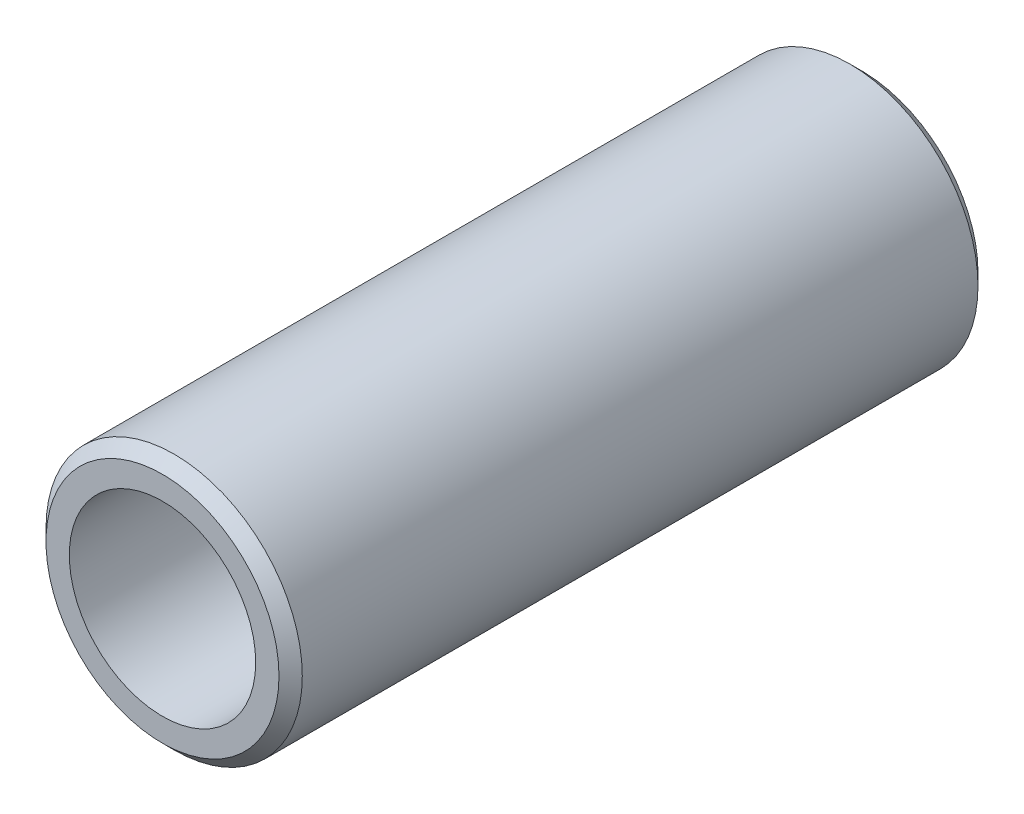
ISO-10303-21;
HEADER;
FILE_DESCRIPTION(('STEP AP214'),'2;1');
FILE_NAME('part.step','',(''),(''),'','','');
FILE_SCHEMA(('AUTOMOTIVE_DESIGN { 1 0 10303 214 1 1 1 1 }'));
ENDSEC;
DATA;
#1=APPLICATION_CONTEXT('core data for automotive mechanical design processes');
#2=APPLICATION_PROTOCOL_DEFINITION('international standard','automotive_design',2000,#1);
#3=PRODUCT_CONTEXT('',#1,'mechanical');
#4=PRODUCT('Part','Part','',(#3));
#5=PRODUCT_RELATED_PRODUCT_CATEGORY('part','',(#4));
#6=PRODUCT_DEFINITION_FORMATION('','',#4);
#7=PRODUCT_DEFINITION_CONTEXT('part definition',#1,'design');
#8=PRODUCT_DEFINITION('design','',#6,#7);
#9=PRODUCT_DEFINITION_SHAPE('','',#8);
#10=(LENGTH_UNIT() NAMED_UNIT(*) SI_UNIT(.MILLI.,.METRE.));
#11=(NAMED_UNIT(*) PLANE_ANGLE_UNIT() SI_UNIT($,.RADIAN.));
#12=(NAMED_UNIT(*) SI_UNIT($,.STERADIAN.) SOLID_ANGLE_UNIT());
#13=UNCERTAINTY_MEASURE_WITH_UNIT(LENGTH_MEASURE(1.E-05),#10,'distance_accuracy_value','');
#14=(GEOMETRIC_REPRESENTATION_CONTEXT(3) GLOBAL_UNCERTAINTY_ASSIGNED_CONTEXT((#13)) GLOBAL_UNIT_ASSIGNED_CONTEXT((#10,
#11,#12)) REPRESENTATION_CONTEXT('',''));
#15=CARTESIAN_POINT('',(0.,0.,0.));
#16=DIRECTION('',(0.,0.,1.));
#17=DIRECTION('',(1.,0.,0.));
#18=AXIS2_PLACEMENT_3D('',#15,#16,#17);
#19=CARTESIAN_POINT('',(0.,0.,30.));
#20=DIRECTION('',(0.,0.,-1.));
#21=DIRECTION('',(-1.,0.,0.));
#22=AXIS2_PLACEMENT_3D('',#19,#20,#21);
#23=CYLINDRICAL_SURFACE('',#22,5.5);
#24=CARTESIAN_POINT('',(0.,0.,0.500000000000007));
#25=DIRECTION('',(0.,0.,1.));
#26=DIRECTION('',(1.,0.,0.));
#27=AXIS2_PLACEMENT_3D('',#24,#25,#26);
#28=CIRCLE('',#27,5.5);
#29=CARTESIAN_POINT('',(5.5,0.,0.500000000000007));
#30=VERTEX_POINT('',#29);
#31=EDGE_CURVE('E41',#30,#30,#28,.T.);
#32=ORIENTED_EDGE('',*,*,#31,.T.);
#33=EDGE_LOOP('',(#32));
#34=FACE_BOUND('',#33,.T.);
#35=CARTESIAN_POINT('',(0.,0.,29.5));
#36=DIRECTION('',(0.,0.,1.));
#37=DIRECTION('',(1.,0.,0.));
#38=AXIS2_PLACEMENT_3D('',#35,#36,#37);
#39=CIRCLE('',#38,5.5);
#40=CARTESIAN_POINT('',(5.5,0.,29.5));
#41=VERTEX_POINT('',#40);
#42=EDGE_CURVE('E45',#41,#41,#39,.F.);
#43=ORIENTED_EDGE('',*,*,#42,.T.);
#44=EDGE_LOOP('',(#43));
#45=FACE_BOUND('',#44,.T.);
#46=ADVANCED_FACE('F30',(#34,#45),#23,.T.);
#47=CARTESIAN_POINT('',(0.,0.,30.));
#48=DIRECTION('',(0.,0.,1.));
#49=DIRECTION('',(1.,0.,0.));
#50=AXIS2_PLACEMENT_3D('',#47,#48,#49);
#51=PLANE('',#50);
#52=CARTESIAN_POINT('',(0.,0.,30.));
#53=DIRECTION('',(0.,0.,1.));
#54=DIRECTION('',(1.,0.,0.));
#55=AXIS2_PLACEMENT_3D('',#52,#53,#54);
#56=CIRCLE('',#55,4.99999999999999);
#57=CARTESIAN_POINT('',(4.99999999999999,0.,30.));
#58=VERTEX_POINT('',#57);
#59=EDGE_CURVE('E10',#58,#58,#56,.T.);
#60=ORIENTED_EDGE('',*,*,#59,.T.);
#61=EDGE_LOOP('',(#60));
#62=FACE_BOUND('',#61,.T.);
#63=CARTESIAN_POINT('',(0.,0.,30.));
#64=DIRECTION('',(0.,0.,1.));
#65=DIRECTION('',(1.,0.,0.));
#66=AXIS2_PLACEMENT_3D('',#63,#64,#65);
#67=CIRCLE('',#66,4.);
#68=CARTESIAN_POINT('',(4.,0.,30.));
#69=VERTEX_POINT('',#68);
#70=EDGE_CURVE('E51',#69,#69,#67,.T.);
#71=ORIENTED_EDGE('',*,*,#70,.F.);
#72=EDGE_LOOP('',(#71));
#73=FACE_BOUND('',#72,.T.);
#74=ADVANCED_FACE('F66',(#62,#73),#51,.T.);
#75=CARTESIAN_POINT('',(0.,0.,0.));
#76=DIRECTION('',(0.,0.,1.));
#77=DIRECTION('',(1.,0.,0.));
#78=AXIS2_PLACEMENT_3D('',#75,#76,#77);
#79=PLANE('',#78);
#80=CARTESIAN_POINT('',(0.,0.,0.));
#81=DIRECTION('',(0.,0.,1.));
#82=DIRECTION('',(1.,0.,0.));
#83=AXIS2_PLACEMENT_3D('',#80,#81,#82);
#84=CIRCLE('',#83,4.99999999999999);
#85=CARTESIAN_POINT('',(4.99999999999999,0.,0.));
#86=VERTEX_POINT('',#85);
#87=EDGE_CURVE('E37',#86,#86,#84,.F.);
#88=ORIENTED_EDGE('',*,*,#87,.T.);
#89=EDGE_LOOP('',(#88));
#90=FACE_BOUND('',#89,.T.);
#91=CARTESIAN_POINT('',(0.,0.,0.));
#92=DIRECTION('',(0.,0.,1.));
#93=DIRECTION('',(1.,0.,0.));
#94=AXIS2_PLACEMENT_3D('',#91,#92,#93);
#95=CIRCLE('',#94,4.);
#96=CARTESIAN_POINT('',(4.,0.,0.));
#97=VERTEX_POINT('',#96);
#98=EDGE_CURVE('E50',#97,#97,#95,.T.);
#99=ORIENTED_EDGE('',*,*,#98,.T.);
#100=EDGE_LOOP('',(#99));
#101=FACE_BOUND('',#100,.T.);
#102=ADVANCED_FACE('F57',(#90,#101),#79,.F.);
#103=CARTESIAN_POINT('',(0.,0.,0.));
#104=DIRECTION('',(0.,0.,1.));
#105=DIRECTION('',(1.,0.,0.));
#106=AXIS2_PLACEMENT_3D('',#103,#104,#105);
#107=CYLINDRICAL_SURFACE('',#106,4.);
#108=ORIENTED_EDGE('',*,*,#98,.F.);
#109=EDGE_LOOP('',(#108));
#110=FACE_BOUND('',#109,.T.);
#111=ORIENTED_EDGE('',*,*,#70,.T.);
#112=EDGE_LOOP('',(#111));
#113=FACE_BOUND('',#112,.T.);
#114=ADVANCED_FACE('F59',(#110,#113),#107,.F.);
#115=CARTESIAN_POINT('',(0.,0.,0.500000000000007));
#116=DIRECTION('',(0.,0.,1.));
#117=DIRECTION('',(1.,0.,0.));
#118=AXIS2_PLACEMENT_3D('',#115,#116,#117);
#119=CONICAL_SURFACE('',#118,5.5,0.785398163397448);
#120=ORIENTED_EDGE('',*,*,#87,.F.);
#121=EDGE_LOOP('',(#120));
#122=FACE_BOUND('',#121,.T.);
#123=ORIENTED_EDGE('',*,*,#31,.F.);
#124=EDGE_LOOP('',(#123));
#125=FACE_BOUND('',#124,.T.);
#126=ADVANCED_FACE('F62',(#122,#125),#119,.T.);
#127=CARTESIAN_POINT('',(0.,0.,30.));
#128=DIRECTION('',(0.,0.,-1.));
#129=DIRECTION('',(-1.,0.,0.));
#130=AXIS2_PLACEMENT_3D('',#127,#128,#129);
#131=CONICAL_SURFACE('',#130,4.99999999999999,0.785398163397445);
#132=ORIENTED_EDGE('',*,*,#42,.F.);
#133=EDGE_LOOP('',(#132));
#134=FACE_BOUND('',#133,.T.);
#135=ORIENTED_EDGE('',*,*,#59,.F.);
#136=EDGE_LOOP('',(#135));
#137=FACE_BOUND('',#136,.T.);
#138=ADVANCED_FACE('F32',(#134,#137),#131,.T.);
#139=CLOSED_SHELL('',(#46,#74,#102,#114,#126,#138));
#140=MANIFOLD_SOLID_BREP('B2',#139);
#141=ADVANCED_BREP_SHAPE_REPRESENTATION('',(#18,#140),#14);
#142=SHAPE_DEFINITION_REPRESENTATION(#9,#141);
ENDSEC;
END-ISO-10303-21;
